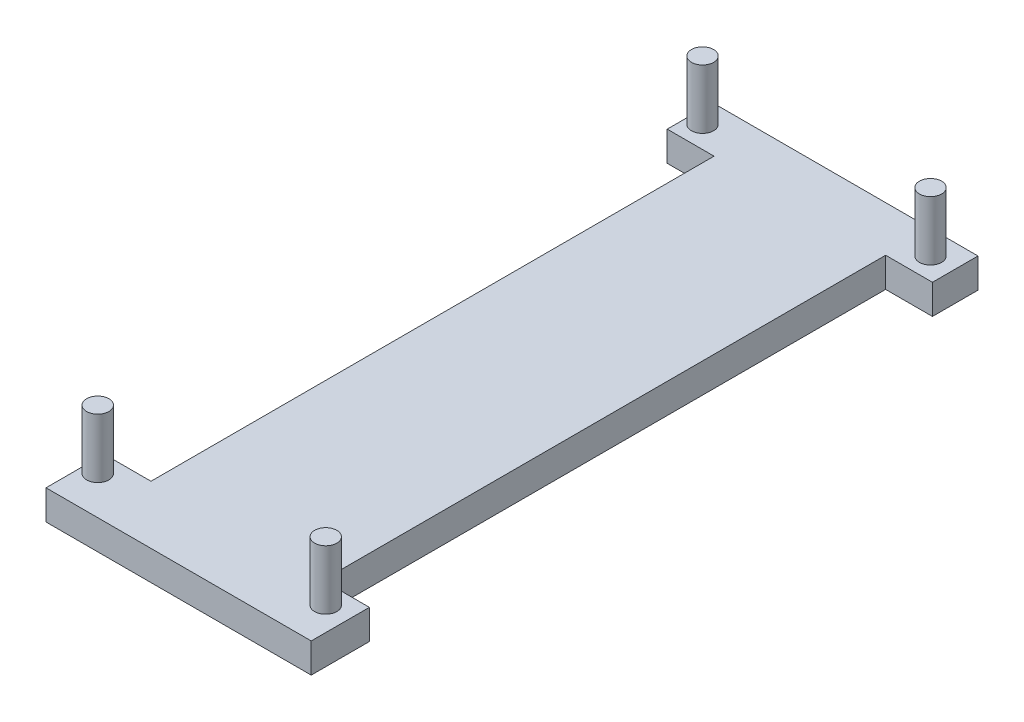
ISO-10303-21;
HEADER;
FILE_DESCRIPTION(('STEP AP214'),'2;1');
FILE_NAME('part.step','',(''),(''),'','','');
FILE_SCHEMA(('AUTOMOTIVE_DESIGN { 1 0 10303 214 1 1 1 1 }'));
ENDSEC;
DATA;
#1=APPLICATION_CONTEXT('core data for automotive mechanical design processes');
#2=APPLICATION_PROTOCOL_DEFINITION('international standard','automotive_design',2000,#1);
#3=PRODUCT_CONTEXT('',#1,'mechanical');
#4=PRODUCT('Part','Part','',(#3));
#5=PRODUCT_RELATED_PRODUCT_CATEGORY('part','',(#4));
#6=PRODUCT_DEFINITION_FORMATION('','',#4);
#7=PRODUCT_DEFINITION_CONTEXT('part definition',#1,'design');
#8=PRODUCT_DEFINITION('design','',#6,#7);
#9=PRODUCT_DEFINITION_SHAPE('','',#8);
#10=(LENGTH_UNIT() NAMED_UNIT(*) SI_UNIT(.MILLI.,.METRE.));
#11=(NAMED_UNIT(*) PLANE_ANGLE_UNIT() SI_UNIT($,.RADIAN.));
#12=(NAMED_UNIT(*) SI_UNIT($,.STERADIAN.) SOLID_ANGLE_UNIT());
#13=UNCERTAINTY_MEASURE_WITH_UNIT(LENGTH_MEASURE(1.E-05),#10,'distance_accuracy_value','');
#14=(GEOMETRIC_REPRESENTATION_CONTEXT(3) GLOBAL_UNCERTAINTY_ASSIGNED_CONTEXT((#13)) GLOBAL_UNIT_ASSIGNED_CONTEXT((#10,
#11,#12)) REPRESENTATION_CONTEXT('',''));
#15=CARTESIAN_POINT('',(0.,0.,0.));
#16=DIRECTION('',(0.,0.,1.));
#17=DIRECTION('',(1.,0.,0.));
#18=AXIS2_PLACEMENT_3D('',#15,#16,#17);
#19=CARTESIAN_POINT('',(0.,2.,0.));
#20=DIRECTION('',(1.,0.,0.));
#21=DIRECTION('',(0.,0.,-1.));
#22=AXIS2_PLACEMENT_3D('',#19,#20,#21);
#23=PLANE('',#22);
#24=DIRECTION('',(0.,0.,1.));
#25=VECTOR('',#24,1.);
#26=CARTESIAN_POINT('',(0.,2.,0.));
#27=LINE('',#26,#25);
#28=CARTESIAN_POINT('',(0.,2.,-3.92568658747146));
#29=VERTEX_POINT('',#28);
#30=CARTESIAN_POINT('',(0.,2.,0.));
#31=VERTEX_POINT('',#30);
#32=EDGE_CURVE('E189',#29,#31,#27,.T.);
#33=ORIENTED_EDGE('',*,*,#32,.F.);
#34=DIRECTION('',(0.,1.,0.));
#35=VECTOR('',#34,1.);
#36=CARTESIAN_POINT('',(0.,-1.5,-3.92568658747146));
#37=LINE('',#36,#35);
#38=CARTESIAN_POINT('',(0.,0.,-3.92568658747146));
#39=VERTEX_POINT('',#38);
#40=EDGE_CURVE('E259',#39,#29,#37,.T.);
#41=ORIENTED_EDGE('',*,*,#40,.F.);
#42=DIRECTION('',(0.,0.,1.));
#43=VECTOR('',#42,1.);
#44=CARTESIAN_POINT('',(0.,0.,0.));
#45=LINE('',#44,#43);
#46=CARTESIAN_POINT('',(0.,0.,0.));
#47=VERTEX_POINT('',#46);
#48=EDGE_CURVE('E180',#39,#47,#45,.T.);
#49=ORIENTED_EDGE('',*,*,#48,.T.);
#50=DIRECTION('',(0.,-1.,0.));
#51=VECTOR('',#50,1.);
#52=CARTESIAN_POINT('',(0.,2.,0.));
#53=LINE('',#52,#51);
#54=EDGE_CURVE('E200',#31,#47,#53,.T.);
#55=ORIENTED_EDGE('',*,*,#54,.F.);
#56=EDGE_LOOP('',(#33,#41,#49,#55));
#57=FACE_BOUND('',#56,.T.);
#58=ADVANCED_FACE('F45',(#57),#23,.F.);
#59=CARTESIAN_POINT('',(17.9,2.,0.));
#60=DIRECTION('',(-1.,0.,0.));
#61=DIRECTION('',(0.,0.,1.));
#62=AXIS2_PLACEMENT_3D('',#59,#60,#61);
#63=PLANE('',#62);
#64=DIRECTION('',(0.,0.,-1.));
#65=VECTOR('',#64,1.);
#66=CARTESIAN_POINT('',(17.9,0.,0.));
#67=LINE('',#66,#65);
#68=CARTESIAN_POINT('',(17.9,0.,0.));
#69=VERTEX_POINT('',#68);
#70=CARTESIAN_POINT('',(17.9,0.,-3.92568658747146));
#71=VERTEX_POINT('',#70);
#72=EDGE_CURVE('E155',#69,#71,#67,.T.);
#73=ORIENTED_EDGE('',*,*,#72,.T.);
#74=DIRECTION('',(0.,1.,0.));
#75=VECTOR('',#74,1.);
#76=CARTESIAN_POINT('',(17.9,-1.5,-3.92568658747146));
#77=LINE('',#76,#75);
#78=CARTESIAN_POINT('',(17.9,2.,-3.92568658747146));
#79=VERTEX_POINT('',#78);
#80=EDGE_CURVE('E136',#71,#79,#77,.T.);
#81=ORIENTED_EDGE('',*,*,#80,.T.);
#82=DIRECTION('',(0.,0.,-1.));
#83=VECTOR('',#82,1.);
#84=CARTESIAN_POINT('',(17.9,2.,0.));
#85=LINE('',#84,#83);
#86=CARTESIAN_POINT('',(17.9,2.,0.));
#87=VERTEX_POINT('',#86);
#88=EDGE_CURVE('E153',#87,#79,#85,.T.);
#89=ORIENTED_EDGE('',*,*,#88,.F.);
#90=DIRECTION('',(0.,-1.,0.));
#91=VECTOR('',#90,1.);
#92=CARTESIAN_POINT('',(17.9,2.,0.));
#93=LINE('',#92,#91);
#94=EDGE_CURVE('E197',#87,#69,#93,.T.);
#95=ORIENTED_EDGE('',*,*,#94,.T.);
#96=EDGE_LOOP('',(#73,#81,#89,#95));
#97=FACE_BOUND('',#96,.T.);
#98=ADVANCED_FACE('F151',(#97),#63,.F.);
#99=CARTESIAN_POINT('',(0.,0.,-45.));
#100=VERTEX_POINT('',#99);
#101=CARTESIAN_POINT('',(0.,0.,-41.9256865874714));
#102=VERTEX_POINT('',#101);
#103=EDGE_CURVE('E175',#100,#102,#45,.T.);
#104=ORIENTED_EDGE('',*,*,#103,.T.);
#105=DIRECTION('',(0.,1.,0.));
#106=VECTOR('',#105,1.);
#107=CARTESIAN_POINT('',(0.,-1.5,-41.9256865874715));
#108=LINE('',#107,#106);
#109=CARTESIAN_POINT('',(0.,2.,-41.9256865874715));
#110=VERTEX_POINT('',#109);
#111=EDGE_CURVE('E69',#102,#110,#108,.T.);
#112=ORIENTED_EDGE('',*,*,#111,.T.);
#113=CARTESIAN_POINT('',(0.,2.,-45.));
#114=VERTEX_POINT('',#113);
#115=EDGE_CURVE('E289',#114,#110,#27,.T.);
#116=ORIENTED_EDGE('',*,*,#115,.F.);
#117=DIRECTION('',(0.,-1.,0.));
#118=VECTOR('',#117,1.);
#119=CARTESIAN_POINT('',(0.,2.,-45.));
#120=LINE('',#119,#118);
#121=EDGE_CURVE('E170',#114,#100,#120,.T.);
#122=ORIENTED_EDGE('',*,*,#121,.T.);
#123=EDGE_LOOP('',(#104,#112,#116,#122));
#124=FACE_BOUND('',#123,.T.);
#125=ADVANCED_FACE('F47',(#124),#23,.F.);
#126=CARTESIAN_POINT('',(0.,2.,0.));
#127=DIRECTION('',(0.,0.,-1.));
#128=DIRECTION('',(-1.,0.,0.));
#129=AXIS2_PLACEMENT_3D('',#126,#127,#128);
#130=PLANE('',#129);
#131=DIRECTION('',(1.,0.,0.));
#132=VECTOR('',#131,1.);
#133=CARTESIAN_POINT('',(0.,0.,0.));
#134=LINE('',#133,#132);
#135=EDGE_CURVE('E179',#47,#69,#134,.T.);
#136=ORIENTED_EDGE('',*,*,#135,.T.);
#137=ORIENTED_EDGE('',*,*,#94,.F.);
#138=DIRECTION('',(1.,0.,0.));
#139=VECTOR('',#138,1.);
#140=CARTESIAN_POINT('',(0.,2.,0.));
#141=LINE('',#140,#139);
#142=EDGE_CURVE('E162',#31,#87,#141,.T.);
#143=ORIENTED_EDGE('',*,*,#142,.F.);
#144=ORIENTED_EDGE('',*,*,#54,.T.);
#145=EDGE_LOOP('',(#136,#137,#143,#144));
#146=FACE_BOUND('',#145,.T.);
#147=ADVANCED_FACE('F303',(#146),#130,.F.);
#148=CARTESIAN_POINT('',(17.9,2.,-41.9256865874715));
#149=VERTEX_POINT('',#148);
#150=CARTESIAN_POINT('',(17.9,2.,-45.));
#151=VERTEX_POINT('',#150);
#152=EDGE_CURVE('E166',#149,#151,#85,.T.);
#153=ORIENTED_EDGE('',*,*,#152,.F.);
#154=DIRECTION('',(0.,1.,0.));
#155=VECTOR('',#154,1.);
#156=CARTESIAN_POINT('',(17.9,-1.5,-41.9256865874715));
#157=LINE('',#156,#155);
#158=CARTESIAN_POINT('',(17.9,0.,-41.9256865874715));
#159=VERTEX_POINT('',#158);
#160=EDGE_CURVE('E157',#159,#149,#157,.T.);
#161=ORIENTED_EDGE('',*,*,#160,.F.);
#162=CARTESIAN_POINT('',(17.9,0.,-45.));
#163=VERTEX_POINT('',#162);
#164=EDGE_CURVE('E183',#159,#163,#67,.T.);
#165=ORIENTED_EDGE('',*,*,#164,.T.);
#166=DIRECTION('',(0.,-1.,0.));
#167=VECTOR('',#166,1.);
#168=CARTESIAN_POINT('',(17.9,2.,-45.));
#169=LINE('',#168,#167);
#170=EDGE_CURVE('E193',#151,#163,#169,.T.);
#171=ORIENTED_EDGE('',*,*,#170,.F.);
#172=EDGE_LOOP('',(#153,#161,#165,#171));
#173=FACE_BOUND('',#172,.T.);
#174=ADVANCED_FACE('F245',(#173),#63,.F.);
#175=CARTESIAN_POINT('',(0.,2.,-45.));
#176=DIRECTION('',(0.,0.,1.));
#177=DIRECTION('',(1.,0.,0.));
#178=AXIS2_PLACEMENT_3D('',#175,#176,#177);
#179=PLANE('',#178);
#180=DIRECTION('',(-1.,0.,0.));
#181=VECTOR('',#180,1.);
#182=CARTESIAN_POINT('',(0.,0.,-45.));
#183=LINE('',#182,#181);
#184=EDGE_CURVE('E186',#163,#100,#183,.T.);
#185=ORIENTED_EDGE('',*,*,#184,.T.);
#186=ORIENTED_EDGE('',*,*,#121,.F.);
#187=DIRECTION('',(-1.,0.,0.));
#188=VECTOR('',#187,1.);
#189=CARTESIAN_POINT('',(0.,2.,-45.));
#190=LINE('',#189,#188);
#191=EDGE_CURVE('E165',#151,#114,#190,.T.);
#192=ORIENTED_EDGE('',*,*,#191,.F.);
#193=ORIENTED_EDGE('',*,*,#170,.T.);
#194=EDGE_LOOP('',(#185,#186,#192,#193));
#195=FACE_BOUND('',#194,.T.);
#196=ADVANCED_FACE('F316',(#195),#179,.F.);
#197=CARTESIAN_POINT('',(0.,2.,0.));
#198=DIRECTION('',(0.,-1.,0.));
#199=DIRECTION('',(0.,0.,-1.));
#200=AXIS2_PLACEMENT_3D('',#197,#198,#199);
#201=PLANE('',#200);
#202=CARTESIAN_POINT('',(0.913071853165764,2.,-2.58));
#203=DIRECTION('',(0.,-1.,0.));
#204=DIRECTION('',(0.,0.,-1.));
#205=AXIS2_PLACEMENT_3D('',#202,#203,#204);
#206=CIRCLE('',#205,0.750000000000001);
#207=CARTESIAN_POINT('',(0.913071853165764,2.,-3.33));
#208=VERTEX_POINT('',#207);
#209=EDGE_CURVE('E216',#208,#208,#206,.F.);
#210=ORIENTED_EDGE('',*,*,#209,.F.);
#211=EDGE_LOOP('',(#210));
#212=FACE_BOUND('',#211,.T.);
#213=CARTESIAN_POINT('',(16.3004818162506,2.,-2.58));
#214=DIRECTION('',(0.,-1.,0.));
#215=DIRECTION('',(0.,0.,-1.));
#216=AXIS2_PLACEMENT_3D('',#213,#214,#215);
#217=CIRCLE('',#216,0.750000000000002);
#218=CARTESIAN_POINT('',(16.3004818162506,2.,-3.33));
#219=VERTEX_POINT('',#218);
#220=EDGE_CURVE('E212',#219,#219,#217,.F.);
#221=ORIENTED_EDGE('',*,*,#220,.F.);
#222=EDGE_LOOP('',(#221));
#223=FACE_BOUND('',#222,.T.);
#224=CARTESIAN_POINT('',(16.3004818162506,2.,-43.3965938071611));
#225=DIRECTION('',(0.,-1.,0.));
#226=DIRECTION('',(0.,0.,-1.));
#227=AXIS2_PLACEMENT_3D('',#224,#225,#226);
#228=CIRCLE('',#227,0.750000000000002);
#229=CARTESIAN_POINT('',(16.3004818162506,2.,-44.1465938071611));
#230=VERTEX_POINT('',#229);
#231=EDGE_CURVE('E208',#230,#230,#228,.F.);
#232=ORIENTED_EDGE('',*,*,#231,.F.);
#233=EDGE_LOOP('',(#232));
#234=FACE_BOUND('',#233,.T.);
#235=CARTESIAN_POINT('',(0.913071853165764,2.,-43.3965938071611));
#236=DIRECTION('',(0.,-1.,0.));
#237=DIRECTION('',(0.,0.,-1.));
#238=AXIS2_PLACEMENT_3D('',#235,#236,#237);
#239=CIRCLE('',#238,0.750000000000001);
#240=CARTESIAN_POINT('',(0.913071853165764,2.,-44.1465938071611));
#241=VERTEX_POINT('',#240);
#242=EDGE_CURVE('E204',#241,#241,#239,.F.);
#243=ORIENTED_EDGE('',*,*,#242,.F.);
#244=EDGE_LOOP('',(#243));
#245=FACE_BOUND('',#244,.T.);
#246=ORIENTED_EDGE('',*,*,#88,.T.);
#247=DIRECTION('',(1.,0.,0.));
#248=VECTOR('',#247,1.);
#249=CARTESIAN_POINT('',(14.74,2.,-3.92568658747146));
#250=LINE('',#249,#248);
#251=CARTESIAN_POINT('',(14.74,2.,-3.92568658747146));
#252=VERTEX_POINT('',#251);
#253=EDGE_CURVE('E133',#252,#79,#250,.T.);
#254=ORIENTED_EDGE('',*,*,#253,.F.);
#255=DIRECTION('',(0.,0.,1.));
#256=VECTOR('',#255,1.);
#257=CARTESIAN_POINT('',(14.74,2.,-41.9256865874715));
#258=LINE('',#257,#256);
#259=CARTESIAN_POINT('',(14.74,2.,-41.9256865874715));
#260=VERTEX_POINT('',#259);
#261=EDGE_CURVE('E158',#260,#252,#258,.T.);
#262=ORIENTED_EDGE('',*,*,#261,.F.);
#263=DIRECTION('',(-1.,0.,0.));
#264=VECTOR('',#263,1.);
#265=CARTESIAN_POINT('',(14.74,2.,-41.9256865874715));
#266=LINE('',#265,#264);
#267=EDGE_CURVE('E145',#149,#260,#266,.T.);
#268=ORIENTED_EDGE('',*,*,#267,.F.);
#269=ORIENTED_EDGE('',*,*,#152,.T.);
#270=ORIENTED_EDGE('',*,*,#191,.T.);
#271=ORIENTED_EDGE('',*,*,#115,.T.);
#272=DIRECTION('',(-1.,0.,0.));
#273=VECTOR('',#272,1.);
#274=CARTESIAN_POINT('',(0.,2.,-41.9256865874715));
#275=LINE('',#274,#273);
#276=CARTESIAN_POINT('',(3.15999999999999,2.,-41.9256865874715));
#277=VERTEX_POINT('',#276);
#278=EDGE_CURVE('E268',#277,#110,#275,.T.);
#279=ORIENTED_EDGE('',*,*,#278,.F.);
#280=DIRECTION('',(0.,0.,-1.));
#281=VECTOR('',#280,1.);
#282=CARTESIAN_POINT('',(3.15999999999999,2.,-41.9256865874715));
#283=LINE('',#282,#281);
#284=CARTESIAN_POINT('',(3.15999999999999,2.,-3.92568658747146));
#285=VERTEX_POINT('',#284);
#286=EDGE_CURVE('E146',#285,#277,#283,.T.);
#287=ORIENTED_EDGE('',*,*,#286,.F.);
#288=DIRECTION('',(1.,0.,0.));
#289=VECTOR('',#288,1.);
#290=CARTESIAN_POINT('',(0.,2.,-3.92568658747146));
#291=LINE('',#290,#289);
#292=EDGE_CURVE('E256',#29,#285,#291,.T.);
#293=ORIENTED_EDGE('',*,*,#292,.F.);
#294=ORIENTED_EDGE('',*,*,#32,.T.);
#295=ORIENTED_EDGE('',*,*,#142,.T.);
#296=EDGE_LOOP('',(#246,#254,#262,#268,#269,#270,#271,#279,#287,#293,#294,#295));
#297=FACE_BOUND('',#296,.T.);
#298=ADVANCED_FACE('F160',(#212,#223,#234,#245,#297),#201,.F.);
#299=CARTESIAN_POINT('',(0.,0.,0.));
#300=DIRECTION('',(0.,-1.,0.));
#301=DIRECTION('',(0.,0.,-1.));
#302=AXIS2_PLACEMENT_3D('',#299,#300,#301);
#303=PLANE('',#302);
#304=DIRECTION('',(-1.,0.,0.));
#305=VECTOR('',#304,1.);
#306=CARTESIAN_POINT('',(0.,0.,-3.92568658747146));
#307=LINE('',#306,#305);
#308=CARTESIAN_POINT('',(14.74,0.,-3.92568658747146));
#309=VERTEX_POINT('',#308);
#310=EDGE_CURVE('E11',#71,#309,#307,.T.);
#311=ORIENTED_EDGE('',*,*,#310,.F.);
#312=ORIENTED_EDGE('',*,*,#72,.F.);
#313=ORIENTED_EDGE('',*,*,#135,.F.);
#314=ORIENTED_EDGE('',*,*,#48,.F.);
#315=DIRECTION('',(-1.,0.,0.));
#316=VECTOR('',#315,1.);
#317=CARTESIAN_POINT('',(0.,0.,-3.92568658747146));
#318=LINE('',#317,#316);
#319=CARTESIAN_POINT('',(3.15999999999999,0.,-3.92568658747146));
#320=VERTEX_POINT('',#319);
#321=EDGE_CURVE('E226',#320,#39,#318,.T.);
#322=ORIENTED_EDGE('',*,*,#321,.F.);
#323=DIRECTION('',(0.,0.,1.));
#324=VECTOR('',#323,1.);
#325=CARTESIAN_POINT('',(3.15999999999999,0.,0.));
#326=LINE('',#325,#324);
#327=CARTESIAN_POINT('',(3.15999999999999,0.,-41.9256865874715));
#328=VERTEX_POINT('',#327);
#329=EDGE_CURVE('E223',#328,#320,#326,.T.);
#330=ORIENTED_EDGE('',*,*,#329,.F.);
#331=DIRECTION('',(1.,0.,0.));
#332=VECTOR('',#331,1.);
#333=CARTESIAN_POINT('',(0.,0.,-41.9256865874715));
#334=LINE('',#333,#332);
#335=EDGE_CURVE('E220',#102,#328,#334,.T.);
#336=ORIENTED_EDGE('',*,*,#335,.F.);
#337=ORIENTED_EDGE('',*,*,#103,.F.);
#338=ORIENTED_EDGE('',*,*,#184,.F.);
#339=ORIENTED_EDGE('',*,*,#164,.F.);
#340=DIRECTION('',(1.,0.,0.));
#341=VECTOR('',#340,1.);
#342=CARTESIAN_POINT('',(0.,0.,-41.9256865874715));
#343=LINE('',#342,#341);
#344=CARTESIAN_POINT('',(14.74,0.,-41.9256865874715));
#345=VERTEX_POINT('',#344);
#346=EDGE_CURVE('E229',#345,#159,#343,.T.);
#347=ORIENTED_EDGE('',*,*,#346,.F.);
#348=DIRECTION('',(0.,0.,-1.));
#349=VECTOR('',#348,1.);
#350=CARTESIAN_POINT('',(14.74,0.,0.));
#351=LINE('',#350,#349);
#352=EDGE_CURVE('E54',#309,#345,#351,.T.);
#353=ORIENTED_EDGE('',*,*,#352,.F.);
#354=EDGE_LOOP('',(#311,#312,#313,#314,#322,#330,#336,#337,#338,#339,#347,#353));
#355=FACE_BOUND('',#354,.T.);
#356=ADVANCED_FACE('F238',(#355),#303,.T.);
#357=CARTESIAN_POINT('',(0.913071853165764,6.,-43.3965938071611));
#358=DIRECTION('',(0.,-1.,0.));
#359=DIRECTION('',(0.,0.,-1.));
#360=AXIS2_PLACEMENT_3D('',#357,#358,#359);
#361=CYLINDRICAL_SURFACE('',#360,0.750000000000001);
#362=CARTESIAN_POINT('',(0.913071853165764,6.,-43.3965938071611));
#363=DIRECTION('',(0.,1.,0.));
#364=DIRECTION('',(0.,0.,1.));
#365=AXIS2_PLACEMENT_3D('',#362,#363,#364);
#366=CIRCLE('',#365,0.750000000000001);
#367=CARTESIAN_POINT('',(0.913071853165764,6.,-42.6465938071611));
#368=VERTEX_POINT('',#367);
#369=EDGE_CURVE('E286',#368,#368,#366,.T.);
#370=ORIENTED_EDGE('',*,*,#369,.F.);
#371=EDGE_LOOP('',(#370));
#372=FACE_BOUND('',#371,.T.);
#373=ORIENTED_EDGE('',*,*,#242,.T.);
#374=EDGE_LOOP('',(#373));
#375=FACE_BOUND('',#374,.T.);
#376=ADVANCED_FACE('F355',(#372,#375),#361,.T.);
#377=CARTESIAN_POINT('',(0.913071853165764,6.,-43.3965938071611));
#378=DIRECTION('',(0.,1.,0.));
#379=DIRECTION('',(0.,0.,1.));
#380=AXIS2_PLACEMENT_3D('',#377,#378,#379);
#381=PLANE('',#380);
#382=ORIENTED_EDGE('',*,*,#369,.T.);
#383=EDGE_LOOP('',(#382));
#384=FACE_BOUND('',#383,.T.);
#385=ADVANCED_FACE('F361',(#384),#381,.T.);
#386=CARTESIAN_POINT('',(16.3004818162506,6.,-43.3965938071611));
#387=DIRECTION('',(0.,-1.,0.));
#388=DIRECTION('',(0.,0.,-1.));
#389=AXIS2_PLACEMENT_3D('',#386,#387,#388);
#390=CYLINDRICAL_SURFACE('',#389,0.750000000000002);
#391=CARTESIAN_POINT('',(16.3004818162506,6.,-43.3965938071611));
#392=DIRECTION('',(0.,1.,0.));
#393=DIRECTION('',(0.,0.,1.));
#394=AXIS2_PLACEMENT_3D('',#391,#392,#393);
#395=CIRCLE('',#394,0.750000000000002);
#396=CARTESIAN_POINT('',(16.3004818162506,6.,-42.6465938071611));
#397=VERTEX_POINT('',#396);
#398=EDGE_CURVE('E282',#397,#397,#395,.T.);
#399=ORIENTED_EDGE('',*,*,#398,.F.);
#400=EDGE_LOOP('',(#399));
#401=FACE_BOUND('',#400,.T.);
#402=ORIENTED_EDGE('',*,*,#231,.T.);
#403=EDGE_LOOP('',(#402));
#404=FACE_BOUND('',#403,.T.);
#405=ADVANCED_FACE('F365',(#401,#404),#390,.T.);
#406=CARTESIAN_POINT('',(16.3004818162506,6.,-43.3965938071611));
#407=DIRECTION('',(0.,1.,0.));
#408=DIRECTION('',(0.,0.,1.));
#409=AXIS2_PLACEMENT_3D('',#406,#407,#408);
#410=PLANE('',#409);
#411=ORIENTED_EDGE('',*,*,#398,.T.);
#412=EDGE_LOOP('',(#411));
#413=FACE_BOUND('',#412,.T.);
#414=ADVANCED_FACE('F367',(#413),#410,.T.);
#415=CARTESIAN_POINT('',(16.3004818162506,6.,-2.58));
#416=DIRECTION('',(0.,-1.,0.));
#417=DIRECTION('',(0.,0.,-1.));
#418=AXIS2_PLACEMENT_3D('',#415,#416,#417);
#419=CYLINDRICAL_SURFACE('',#418,0.750000000000002);
#420=CARTESIAN_POINT('',(16.3004818162506,6.,-2.58));
#421=DIRECTION('',(0.,1.,0.));
#422=DIRECTION('',(0.,0.,1.));
#423=AXIS2_PLACEMENT_3D('',#420,#421,#422);
#424=CIRCLE('',#423,0.750000000000002);
#425=CARTESIAN_POINT('',(16.3004818162506,6.,-1.83));
#426=VERTEX_POINT('',#425);
#427=EDGE_CURVE('E278',#426,#426,#424,.T.);
#428=ORIENTED_EDGE('',*,*,#427,.F.);
#429=EDGE_LOOP('',(#428));
#430=FACE_BOUND('',#429,.T.);
#431=ORIENTED_EDGE('',*,*,#220,.T.);
#432=EDGE_LOOP('',(#431));
#433=FACE_BOUND('',#432,.T.);
#434=ADVANCED_FACE('F370',(#430,#433),#419,.T.);
#435=CARTESIAN_POINT('',(16.3004818162506,6.,-2.58));
#436=DIRECTION('',(0.,1.,0.));
#437=DIRECTION('',(0.,0.,1.));
#438=AXIS2_PLACEMENT_3D('',#435,#436,#437);
#439=PLANE('',#438);
#440=ORIENTED_EDGE('',*,*,#427,.T.);
#441=EDGE_LOOP('',(#440));
#442=FACE_BOUND('',#441,.T.);
#443=ADVANCED_FACE('F375',(#442),#439,.T.);
#444=CARTESIAN_POINT('',(0.913071853165764,6.,-2.58));
#445=DIRECTION('',(0.,-1.,0.));
#446=DIRECTION('',(0.,0.,-1.));
#447=AXIS2_PLACEMENT_3D('',#444,#445,#446);
#448=CYLINDRICAL_SURFACE('',#447,0.750000000000001);
#449=CARTESIAN_POINT('',(0.913071853165764,6.,-2.58));
#450=DIRECTION('',(0.,1.,0.));
#451=DIRECTION('',(0.,0.,1.));
#452=AXIS2_PLACEMENT_3D('',#449,#450,#451);
#453=CIRCLE('',#452,0.750000000000001);
#454=CARTESIAN_POINT('',(0.913071853165764,6.,-1.83));
#455=VERTEX_POINT('',#454);
#456=EDGE_CURVE('E274',#455,#455,#453,.T.);
#457=ORIENTED_EDGE('',*,*,#456,.F.);
#458=EDGE_LOOP('',(#457));
#459=FACE_BOUND('',#458,.T.);
#460=ORIENTED_EDGE('',*,*,#209,.T.);
#461=EDGE_LOOP('',(#460));
#462=FACE_BOUND('',#461,.T.);
#463=ADVANCED_FACE('F378',(#459,#462),#448,.T.);
#464=CARTESIAN_POINT('',(0.913071853165764,6.,-2.58));
#465=DIRECTION('',(0.,1.,0.));
#466=DIRECTION('',(0.,0.,1.));
#467=AXIS2_PLACEMENT_3D('',#464,#465,#466);
#468=PLANE('',#467);
#469=ORIENTED_EDGE('',*,*,#456,.T.);
#470=EDGE_LOOP('',(#469));
#471=FACE_BOUND('',#470,.T.);
#472=ADVANCED_FACE('F334',(#471),#468,.T.);
#473=CARTESIAN_POINT('',(3.15999999999999,-1.5,-41.9256865874715));
#474=DIRECTION('',(1.,0.,0.));
#475=DIRECTION('',(0.,0.,-1.));
#476=AXIS2_PLACEMENT_3D('',#473,#474,#475);
#477=PLANE('',#476);
#478=ORIENTED_EDGE('',*,*,#329,.T.);
#479=DIRECTION('',(0.,1.,0.));
#480=VECTOR('',#479,1.);
#481=CARTESIAN_POINT('',(3.15999999999999,-1.5,-3.92568658747146));
#482=LINE('',#481,#480);
#483=EDGE_CURVE('E262',#320,#285,#482,.T.);
#484=ORIENTED_EDGE('',*,*,#483,.T.);
#485=ORIENTED_EDGE('',*,*,#286,.T.);
#486=DIRECTION('',(0.,1.,0.));
#487=VECTOR('',#486,1.);
#488=CARTESIAN_POINT('',(3.15999999999999,-1.5,-41.9256865874715));
#489=LINE('',#488,#487);
#490=EDGE_CURVE('E253',#328,#277,#489,.T.);
#491=ORIENTED_EDGE('',*,*,#490,.F.);
#492=EDGE_LOOP('',(#478,#484,#485,#491));
#493=FACE_BOUND('',#492,.T.);
#494=ADVANCED_FACE('F323',(#493),#477,.F.);
#495=CARTESIAN_POINT('',(0.,-1.5,-3.92568658747146));
#496=DIRECTION('',(0.,0.,1.));
#497=DIRECTION('',(1.,0.,0.));
#498=AXIS2_PLACEMENT_3D('',#495,#496,#497);
#499=PLANE('',#498);
#500=ORIENTED_EDGE('',*,*,#321,.T.);
#501=ORIENTED_EDGE('',*,*,#40,.T.);
#502=ORIENTED_EDGE('',*,*,#292,.T.);
#503=ORIENTED_EDGE('',*,*,#483,.F.);
#504=EDGE_LOOP('',(#500,#501,#502,#503));
#505=FACE_BOUND('',#504,.T.);
#506=ADVANCED_FACE('F326',(#505),#499,.F.);
#507=CARTESIAN_POINT('',(0.,-1.5,-41.9256865874715));
#508=DIRECTION('',(0.,0.,-1.));
#509=DIRECTION('',(-1.,0.,0.));
#510=AXIS2_PLACEMENT_3D('',#507,#508,#509);
#511=PLANE('',#510);
#512=ORIENTED_EDGE('',*,*,#335,.T.);
#513=ORIENTED_EDGE('',*,*,#490,.T.);
#514=ORIENTED_EDGE('',*,*,#278,.T.);
#515=ORIENTED_EDGE('',*,*,#111,.F.);
#516=EDGE_LOOP('',(#512,#513,#514,#515));
#517=FACE_BOUND('',#516,.T.);
#518=ADVANCED_FACE('F321',(#517),#511,.F.);
#519=CARTESIAN_POINT('',(14.74,-1.5,-3.92568658747146));
#520=DIRECTION('',(0.,0.,1.));
#521=DIRECTION('',(1.,0.,0.));
#522=AXIS2_PLACEMENT_3D('',#519,#520,#521);
#523=PLANE('',#522);
#524=ORIENTED_EDGE('',*,*,#310,.T.);
#525=DIRECTION('',(0.,1.,0.));
#526=VECTOR('',#525,1.);
#527=CARTESIAN_POINT('',(14.74,-1.5,-3.92568658747146));
#528=LINE('',#527,#526);
#529=EDGE_CURVE('E139',#309,#252,#528,.T.);
#530=ORIENTED_EDGE('',*,*,#529,.T.);
#531=ORIENTED_EDGE('',*,*,#253,.T.);
#532=ORIENTED_EDGE('',*,*,#80,.F.);
#533=EDGE_LOOP('',(#524,#530,#531,#532));
#534=FACE_BOUND('',#533,.T.);
#535=ADVANCED_FACE('F135',(#534),#523,.F.);
#536=CARTESIAN_POINT('',(14.74,-1.5,-41.9256865874715));
#537=DIRECTION('',(-1.,0.,0.));
#538=DIRECTION('',(0.,0.,1.));
#539=AXIS2_PLACEMENT_3D('',#536,#537,#538);
#540=PLANE('',#539);
#541=ORIENTED_EDGE('',*,*,#352,.T.);
#542=DIRECTION('',(0.,1.,0.));
#543=VECTOR('',#542,1.);
#544=CARTESIAN_POINT('',(14.74,-1.5,-41.9256865874715));
#545=LINE('',#544,#543);
#546=EDGE_CURVE('E61',#345,#260,#545,.T.);
#547=ORIENTED_EDGE('',*,*,#546,.T.);
#548=ORIENTED_EDGE('',*,*,#261,.T.);
#549=ORIENTED_EDGE('',*,*,#529,.F.);
#550=EDGE_LOOP('',(#541,#547,#548,#549));
#551=FACE_BOUND('',#550,.T.);
#552=ADVANCED_FACE('F235',(#551),#540,.F.);
#553=CARTESIAN_POINT('',(14.74,-1.5,-41.9256865874715));
#554=DIRECTION('',(0.,0.,-1.));
#555=DIRECTION('',(-1.,0.,0.));
#556=AXIS2_PLACEMENT_3D('',#553,#554,#555);
#557=PLANE('',#556);
#558=ORIENTED_EDGE('',*,*,#346,.T.);
#559=ORIENTED_EDGE('',*,*,#160,.T.);
#560=ORIENTED_EDGE('',*,*,#267,.T.);
#561=ORIENTED_EDGE('',*,*,#546,.F.);
#562=EDGE_LOOP('',(#558,#559,#560,#561));
#563=FACE_BOUND('',#562,.T.);
#564=ADVANCED_FACE('F241',(#563),#557,.F.);
#565=CLOSED_SHELL('',(#58,#98,#125,#147,#174,#196,#298,#356,#376,#385,#405,#414,#434,#443,#463,
#472,#494,#506,#518,#535,#552,#564));
#566=MANIFOLD_SOLID_BREP('B2',#565);
#567=ADVANCED_BREP_SHAPE_REPRESENTATION('',(#18,#566),#14);
#568=SHAPE_DEFINITION_REPRESENTATION(#9,#567);
ENDSEC;
END-ISO-10303-21;
